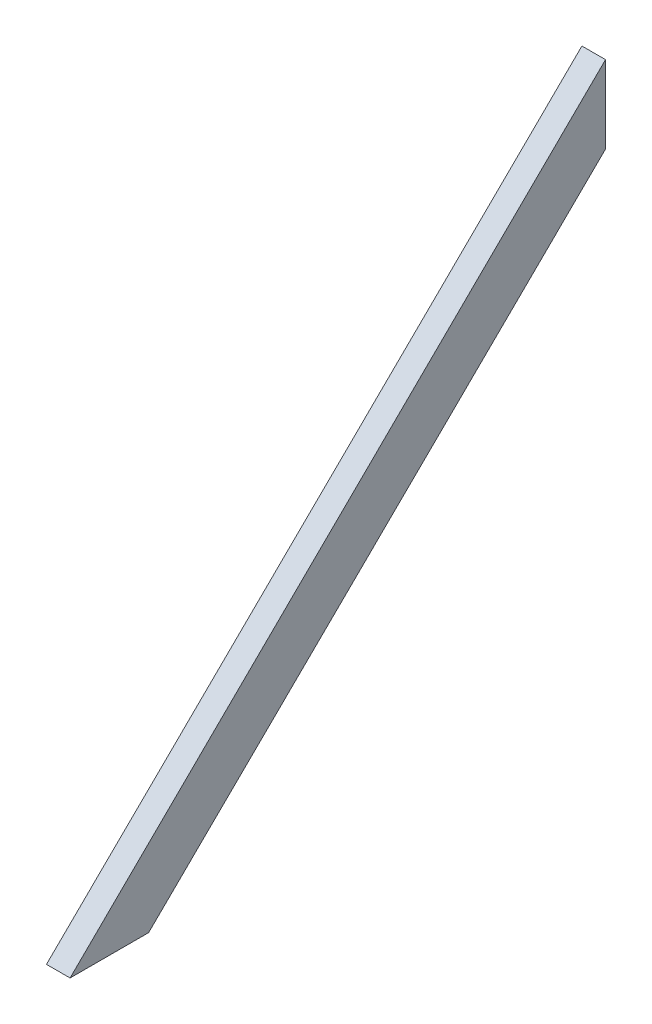
ISO-10303-21;
HEADER;
FILE_DESCRIPTION(('STEP AP214'),'2;1');
FILE_NAME('part.step','',(''),(''),'','','');
FILE_SCHEMA(('AUTOMOTIVE_DESIGN { 1 0 10303 214 1 1 1 1 }'));
ENDSEC;
DATA;
#1=APPLICATION_CONTEXT('core data for automotive mechanical design processes');
#2=APPLICATION_PROTOCOL_DEFINITION('international standard','automotive_design',2000,#1);
#3=PRODUCT_CONTEXT('',#1,'mechanical');
#4=PRODUCT('Part','Part','',(#3));
#5=PRODUCT_RELATED_PRODUCT_CATEGORY('part','',(#4));
#6=PRODUCT_DEFINITION_FORMATION('','',#4);
#7=PRODUCT_DEFINITION_CONTEXT('part definition',#1,'design');
#8=PRODUCT_DEFINITION('design','',#6,#7);
#9=PRODUCT_DEFINITION_SHAPE('','',#8);
#10=(LENGTH_UNIT() NAMED_UNIT(*) SI_UNIT(.MILLI.,.METRE.));
#11=(NAMED_UNIT(*) PLANE_ANGLE_UNIT() SI_UNIT($,.RADIAN.));
#12=(NAMED_UNIT(*) SI_UNIT($,.STERADIAN.) SOLID_ANGLE_UNIT());
#13=UNCERTAINTY_MEASURE_WITH_UNIT(LENGTH_MEASURE(1.E-05),#10,'distance_accuracy_value','');
#14=(GEOMETRIC_REPRESENTATION_CONTEXT(3) GLOBAL_UNCERTAINTY_ASSIGNED_CONTEXT((#13)) GLOBAL_UNIT_ASSIGNED_CONTEXT((#10,
#11,#12)) REPRESENTATION_CONTEXT('',''));
#15=CARTESIAN_POINT('',(0.,0.,0.));
#16=DIRECTION('',(0.,0.,1.));
#17=DIRECTION('',(1.,0.,0.));
#18=AXIS2_PLACEMENT_3D('',#15,#16,#17);
#19=CARTESIAN_POINT('',(38.1,-425.45,431.8));
#20=DIRECTION('',(0.,1.,0.));
#21=DIRECTION('',(0.,0.,1.));
#22=AXIS2_PLACEMENT_3D('',#19,#20,#21);
#23=PLANE('',#22);
#24=DIRECTION('',(0.,0.,-1.));
#25=VECTOR('',#24,1.);
#26=CARTESIAN_POINT('',(0.,-425.45,431.8));
#27=LINE('',#26,#25);
#28=CARTESIAN_POINT('',(0.,-425.45,431.8));
#29=VERTEX_POINT('',#28);
#30=CARTESIAN_POINT('',(0.,-425.45,305.134703691467));
#31=VERTEX_POINT('',#30);
#32=EDGE_CURVE('E96',#29,#31,#27,.T.);
#33=ORIENTED_EDGE('',*,*,#32,.T.);
#34=DIRECTION('',(-1.,0.,0.));
#35=VECTOR('',#34,1.);
#36=CARTESIAN_POINT('',(38.1,-425.45,305.134703691467));
#37=LINE('',#36,#35);
#38=CARTESIAN_POINT('',(38.1,-425.45,305.134703691467));
#39=VERTEX_POINT('',#38);
#40=EDGE_CURVE('E11',#39,#31,#37,.T.);
#41=ORIENTED_EDGE('',*,*,#40,.F.);
#42=DIRECTION('',(0.,0.,-1.));
#43=VECTOR('',#42,1.);
#44=CARTESIAN_POINT('',(38.1,-425.45,431.8));
#45=LINE('',#44,#43);
#46=CARTESIAN_POINT('',(38.1,-425.45,431.8));
#47=VERTEX_POINT('',#46);
#48=EDGE_CURVE('E82',#47,#39,#45,.T.);
#49=ORIENTED_EDGE('',*,*,#48,.F.);
#50=DIRECTION('',(-1.,0.,0.));
#51=VECTOR('',#50,1.);
#52=CARTESIAN_POINT('',(38.1,-425.45,431.8));
#53=LINE('',#52,#51);
#54=EDGE_CURVE('E49',#47,#29,#53,.T.);
#55=ORIENTED_EDGE('',*,*,#54,.T.);
#56=EDGE_LOOP('',(#33,#41,#49,#55));
#57=FACE_BOUND('',#56,.T.);
#58=ADVANCED_FACE('F33',(#57),#23,.F.);
#59=CARTESIAN_POINT('',(38.1,-425.45,305.134703691467));
#60=DIRECTION('',(0.,0.712325066937561,0.701849698306126));
#61=DIRECTION('',(0.,-0.701849698306126,0.712325066937561));
#62=AXIS2_PLACEMENT_3D('',#59,#60,#61);
#63=PLANE('',#62);
#64=DIRECTION('',(0.,0.701849698306126,-0.712325066937561));
#65=VECTOR('',#64,1.);
#66=CARTESIAN_POINT('',(0.,-425.45,305.134703691467));
#67=LINE('',#66,#65);
#68=CARTESIAN_POINT('',(0.,300.647428637181,-431.8));
#69=VERTEX_POINT('',#68);
#70=EDGE_CURVE('E87',#31,#69,#67,.T.);
#71=ORIENTED_EDGE('',*,*,#70,.T.);
#72=DIRECTION('',(-1.,0.,0.));
#73=VECTOR('',#72,1.);
#74=CARTESIAN_POINT('',(38.1,300.647428637181,-431.8));
#75=LINE('',#74,#73);
#76=CARTESIAN_POINT('',(38.1,300.647428637181,-431.8));
#77=VERTEX_POINT('',#76);
#78=EDGE_CURVE('E41',#77,#69,#75,.T.);
#79=ORIENTED_EDGE('',*,*,#78,.F.);
#80=DIRECTION('',(0.,0.701849698306126,-0.712325066937561));
#81=VECTOR('',#80,1.);
#82=CARTESIAN_POINT('',(38.1,-425.45,305.134703691467));
#83=LINE('',#82,#81);
#84=EDGE_CURVE('E75',#39,#77,#83,.T.);
#85=ORIENTED_EDGE('',*,*,#84,.F.);
#86=ORIENTED_EDGE('',*,*,#40,.T.);
#87=EDGE_LOOP('',(#71,#79,#85,#86));
#88=FACE_BOUND('',#87,.T.);
#89=ADVANCED_FACE('F86',(#88),#63,.F.);
#90=CARTESIAN_POINT('',(38.1,300.647428637181,-431.8));
#91=DIRECTION('',(0.,0.,1.));
#92=DIRECTION('',(1.,0.,0.));
#93=AXIS2_PLACEMENT_3D('',#90,#91,#92);
#94=PLANE('',#93);
#95=DIRECTION('',(0.,1.,0.));
#96=VECTOR('',#95,1.);
#97=CARTESIAN_POINT('',(0.,300.647428637181,-431.8));
#98=LINE('',#97,#96);
#99=CARTESIAN_POINT('',(0.,425.45,-431.8));
#100=VERTEX_POINT('',#99);
#101=EDGE_CURVE('E99',#69,#100,#98,.T.);
#102=ORIENTED_EDGE('',*,*,#101,.T.);
#103=DIRECTION('',(-1.,0.,0.));
#104=VECTOR('',#103,1.);
#105=CARTESIAN_POINT('',(38.1,425.45,-431.8));
#106=LINE('',#105,#104);
#107=CARTESIAN_POINT('',(38.1,425.45,-431.8));
#108=VERTEX_POINT('',#107);
#109=EDGE_CURVE('E64',#108,#100,#106,.T.);
#110=ORIENTED_EDGE('',*,*,#109,.F.);
#111=DIRECTION('',(0.,1.,0.));
#112=VECTOR('',#111,1.);
#113=CARTESIAN_POINT('',(38.1,300.647428637181,-431.8));
#114=LINE('',#113,#112);
#115=EDGE_CURVE('E81',#77,#108,#114,.T.);
#116=ORIENTED_EDGE('',*,*,#115,.F.);
#117=ORIENTED_EDGE('',*,*,#78,.T.);
#118=EDGE_LOOP('',(#102,#110,#116,#117));
#119=FACE_BOUND('',#118,.T.);
#120=ADVANCED_FACE('F90',(#119),#94,.F.);
#121=CARTESIAN_POINT('',(38.1,-425.45,431.8));
#122=DIRECTION('',(0.,0.712325066937561,0.701849698306126));
#123=DIRECTION('',(0.,-0.701849698306126,0.712325066937561));
#124=AXIS2_PLACEMENT_3D('',#121,#122,#123);
#125=PLANE('',#124);
#126=DIRECTION('',(0.,0.701849698306126,-0.712325066937561));
#127=VECTOR('',#126,1.);
#128=CARTESIAN_POINT('',(0.,-425.45,431.8));
#129=LINE('',#128,#127);
#130=EDGE_CURVE('E101',#29,#100,#129,.T.);
#131=ORIENTED_EDGE('',*,*,#130,.F.);
#132=ORIENTED_EDGE('',*,*,#54,.F.);
#133=DIRECTION('',(0.,0.701849698306126,-0.712325066937561));
#134=VECTOR('',#133,1.);
#135=CARTESIAN_POINT('',(38.1,-425.45,431.8));
#136=LINE('',#135,#134);
#137=EDGE_CURVE('E91',#47,#108,#136,.T.);
#138=ORIENTED_EDGE('',*,*,#137,.T.);
#139=ORIENTED_EDGE('',*,*,#109,.T.);
#140=EDGE_LOOP('',(#131,#132,#138,#139));
#141=FACE_BOUND('',#140,.T.);
#142=ADVANCED_FACE('F107',(#141),#125,.T.);
#143=CARTESIAN_POINT('',(38.1,0.,0.));
#144=DIRECTION('',(1.,0.,0.));
#145=DIRECTION('',(0.,0.,-1.));
#146=AXIS2_PLACEMENT_3D('',#143,#144,#145);
#147=PLANE('',#146);
#148=ORIENTED_EDGE('',*,*,#48,.T.);
#149=ORIENTED_EDGE('',*,*,#84,.T.);
#150=ORIENTED_EDGE('',*,*,#115,.T.);
#151=ORIENTED_EDGE('',*,*,#137,.F.);
#152=EDGE_LOOP('',(#148,#149,#150,#151));
#153=FACE_BOUND('',#152,.T.);
#154=ADVANCED_FACE('F78',(#153),#147,.T.);
#155=CARTESIAN_POINT('',(0.,0.,0.));
#156=DIRECTION('',(1.,0.,0.));
#157=DIRECTION('',(0.,0.,-1.));
#158=AXIS2_PLACEMENT_3D('',#155,#156,#157);
#159=PLANE('',#158);
#160=ORIENTED_EDGE('',*,*,#32,.F.);
#161=ORIENTED_EDGE('',*,*,#130,.T.);
#162=ORIENTED_EDGE('',*,*,#101,.F.);
#163=ORIENTED_EDGE('',*,*,#70,.F.);
#164=EDGE_LOOP('',(#160,#161,#162,#163));
#165=FACE_BOUND('',#164,.T.);
#166=ADVANCED_FACE('F106',(#165),#159,.F.);
#167=CLOSED_SHELL('',(#58,#89,#120,#142,#154,#166));
#168=MANIFOLD_SOLID_BREP('B2',#167);
#169=ADVANCED_BREP_SHAPE_REPRESENTATION('',(#18,#168),#14);
#170=SHAPE_DEFINITION_REPRESENTATION(#9,#169);
ENDSEC;
END-ISO-10303-21;
